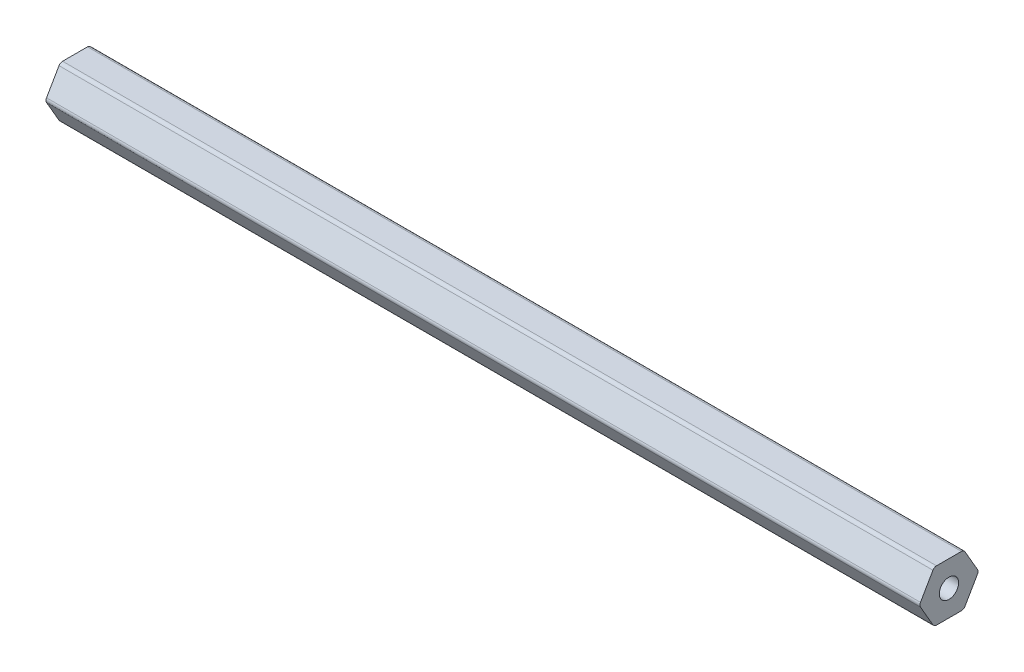
ISO-10303-21;
HEADER;
FILE_DESCRIPTION(('STEP AP214'),'2;1');
FILE_NAME('part.step','',(''),(''),'','','');
FILE_SCHEMA(('AUTOMOTIVE_DESIGN { 1 0 10303 214 1 1 1 1 }'));
ENDSEC;
DATA;
#1=APPLICATION_CONTEXT('core data for automotive mechanical design processes');
#2=APPLICATION_PROTOCOL_DEFINITION('international standard','automotive_design',2000,#1);
#3=PRODUCT_CONTEXT('',#1,'mechanical');
#4=PRODUCT('Part','Part','',(#3));
#5=PRODUCT_RELATED_PRODUCT_CATEGORY('part','',(#4));
#6=PRODUCT_DEFINITION_FORMATION('','',#4);
#7=PRODUCT_DEFINITION_CONTEXT('part definition',#1,'design');
#8=PRODUCT_DEFINITION('design','',#6,#7);
#9=PRODUCT_DEFINITION_SHAPE('','',#8);
#10=(LENGTH_UNIT() NAMED_UNIT(*) SI_UNIT(.MILLI.,.METRE.));
#11=(NAMED_UNIT(*) PLANE_ANGLE_UNIT() SI_UNIT($,.RADIAN.));
#12=(NAMED_UNIT(*) SI_UNIT($,.STERADIAN.) SOLID_ANGLE_UNIT());
#13=UNCERTAINTY_MEASURE_WITH_UNIT(LENGTH_MEASURE(1.E-05),#10,'distance_accuracy_value','');
#14=(GEOMETRIC_REPRESENTATION_CONTEXT(3) GLOBAL_UNCERTAINTY_ASSIGNED_CONTEXT((#13)) GLOBAL_UNIT_ASSIGNED_CONTEXT((#10,
#11,#12)) REPRESENTATION_CONTEXT('',''));
#15=CARTESIAN_POINT('',(0.,0.,0.));
#16=DIRECTION('',(0.,0.,1.));
#17=DIRECTION('',(1.,0.,0.));
#18=AXIS2_PLACEMENT_3D('',#15,#16,#17);
#19=CARTESIAN_POINT('',(215.9,5.334,-3.07958633585748));
#20=DIRECTION('',(-1.,0.,0.));
#21=DIRECTION('',(0.,0.,1.));
#22=AXIS2_PLACEMENT_3D('',#19,#20,#21);
#23=PLANE('',#22);
#24=CARTESIAN_POINT('',(215.9,5.334,-3.07958633585748));
#25=DIRECTION('',(1.,0.,0.));
#26=DIRECTION('',(0.,0.,1.));
#27=AXIS2_PLACEMENT_3D('',#24,#25,#26);
#28=CIRCLE('',#27,1.016);
#29=CARTESIAN_POINT('',(215.9,5.84199999999999,-3.95946814610247));
#30=VERTEX_POINT('',#29);
#31=CARTESIAN_POINT('',(215.9,6.34999999999999,-3.07958633585748));
#32=VERTEX_POINT('',#31);
#33=EDGE_CURVE('E206',#30,#32,#28,.T.);
#34=ORIENTED_EDGE('',*,*,#33,.T.);
#35=DIRECTION('',(0.,0.,1.));
#36=VECTOR('',#35,1.);
#37=CARTESIAN_POINT('',(215.9,6.34999999999999,-3.07958633585748));
#38=LINE('',#37,#36);
#39=CARTESIAN_POINT('',(215.9,6.35000000000001,3.07958633585745));
#40=VERTEX_POINT('',#39);
#41=EDGE_CURVE('E118',#32,#40,#38,.T.);
#42=ORIENTED_EDGE('',*,*,#41,.T.);
#43=CARTESIAN_POINT('',(215.9,5.33400000000001,3.07958633585745));
#44=DIRECTION('',(1.,0.,0.));
#45=DIRECTION('',(0.,0.,1.));
#46=AXIS2_PLACEMENT_3D('',#43,#44,#45);
#47=CIRCLE('',#46,1.016);
#48=CARTESIAN_POINT('',(215.9,5.84200000000001,3.95946814610244));
#49=VERTEX_POINT('',#48);
#50=EDGE_CURVE('E243',#40,#49,#47,.T.);
#51=ORIENTED_EDGE('',*,*,#50,.T.);
#52=DIRECTION('',(0.,-0.866025403784437,0.500000000000003));
#53=VECTOR('',#52,1.);
#54=CARTESIAN_POINT('',(215.9,5.84200000000001,3.95946814610244));
#55=LINE('',#54,#53);
#56=CARTESIAN_POINT('',(215.9,0.508000000000022,7.03905448195992));
#57=VERTEX_POINT('',#56);
#58=EDGE_CURVE('E263',#49,#57,#55,.T.);
#59=ORIENTED_EDGE('',*,*,#58,.T.);
#60=CARTESIAN_POINT('',(215.9,0.,6.15917267171493));
#61=DIRECTION('',(1.,0.,0.));
#62=DIRECTION('',(0.,0.,1.));
#63=AXIS2_PLACEMENT_3D('',#60,#61,#62);
#64=CIRCLE('',#63,1.016);
#65=CARTESIAN_POINT('',(215.9,-0.50799999999998,7.03905448195993));
#66=VERTEX_POINT('',#65);
#67=EDGE_CURVE('E259',#57,#66,#64,.T.);
#68=ORIENTED_EDGE('',*,*,#67,.T.);
#69=DIRECTION('',(0.,-0.86602540378444,-0.499999999999998));
#70=VECTOR('',#69,1.);
#71=CARTESIAN_POINT('',(215.9,-0.507999999999979,7.03905448195992));
#72=LINE('',#71,#70);
#73=CARTESIAN_POINT('',(215.9,-5.84199999999999,3.95946814610247));
#74=VERTEX_POINT('',#73);
#75=EDGE_CURVE('E262',#66,#74,#72,.T.);
#76=ORIENTED_EDGE('',*,*,#75,.T.);
#77=CARTESIAN_POINT('',(215.9,-5.334,3.07958633585748));
#78=DIRECTION('',(1.,0.,0.));
#79=DIRECTION('',(0.,0.,1.));
#80=AXIS2_PLACEMENT_3D('',#77,#78,#79);
#81=CIRCLE('',#80,1.016);
#82=CARTESIAN_POINT('',(215.9,-6.35,3.07958633585748));
#83=VERTEX_POINT('',#82);
#84=EDGE_CURVE('E267',#74,#83,#81,.T.);
#85=ORIENTED_EDGE('',*,*,#84,.T.);
#86=DIRECTION('',(0.,0.,-1.));
#87=VECTOR('',#86,1.);
#88=CARTESIAN_POINT('',(215.9,-6.35,3.07958633585748));
#89=LINE('',#88,#87);
#90=CARTESIAN_POINT('',(215.9,-6.35000000000001,-3.07958633585745));
#91=VERTEX_POINT('',#90);
#92=EDGE_CURVE('E274',#83,#91,#89,.T.);
#93=ORIENTED_EDGE('',*,*,#92,.T.);
#94=CARTESIAN_POINT('',(215.9,-5.33400000000001,-3.07958633585745));
#95=DIRECTION('',(1.,0.,0.));
#96=DIRECTION('',(0.,0.,1.));
#97=AXIS2_PLACEMENT_3D('',#94,#95,#96);
#98=CIRCLE('',#97,1.016);
#99=CARTESIAN_POINT('',(215.9,-5.84200000000001,-3.95946814610244));
#100=VERTEX_POINT('',#99);
#101=EDGE_CURVE('E149',#91,#100,#98,.T.);
#102=ORIENTED_EDGE('',*,*,#101,.T.);
#103=DIRECTION('',(0.,0.866025403784437,-0.500000000000002));
#104=VECTOR('',#103,1.);
#105=CARTESIAN_POINT('',(215.9,-5.84200000000001,-3.95946814610244));
#106=LINE('',#105,#104);
#107=CARTESIAN_POINT('',(215.9,-0.508000000000019,-7.03905448195992));
#108=VERTEX_POINT('',#107);
#109=EDGE_CURVE('E143',#100,#108,#106,.T.);
#110=ORIENTED_EDGE('',*,*,#109,.T.);
#111=CARTESIAN_POINT('',(215.9,0.,-6.15917267171493));
#112=DIRECTION('',(1.,0.,0.));
#113=DIRECTION('',(0.,0.,1.));
#114=AXIS2_PLACEMENT_3D('',#111,#112,#113);
#115=CIRCLE('',#114,1.016);
#116=CARTESIAN_POINT('',(215.9,0.507999999999981,-7.03905448195992));
#117=VERTEX_POINT('',#116);
#118=EDGE_CURVE('E147',#108,#117,#115,.T.);
#119=ORIENTED_EDGE('',*,*,#118,.T.);
#120=DIRECTION('',(0.,0.86602540378444,0.499999999999997));
#121=VECTOR('',#120,1.);
#122=CARTESIAN_POINT('',(215.9,0.50799999999998,-7.03905448195992));
#123=LINE('',#122,#121);
#124=EDGE_CURVE('E63',#117,#30,#123,.T.);
#125=ORIENTED_EDGE('',*,*,#124,.T.);
#126=EDGE_LOOP('',(#34,#42,#51,#59,#68,#76,#85,#93,#102,#110,#119,#125));
#127=FACE_BOUND('',#126,.T.);
#128=CARTESIAN_POINT('',(215.9,0.,0.));
#129=DIRECTION('',(1.,0.,0.));
#130=DIRECTION('',(0.,0.,-1.));
#131=AXIS2_PLACEMENT_3D('',#128,#129,#130);
#132=CIRCLE('',#131,2.38125);
#133=CARTESIAN_POINT('',(215.9,0.,-2.38125));
#134=VERTEX_POINT('',#133);
#135=EDGE_CURVE('E176',#134,#134,#132,.T.);
#136=ORIENTED_EDGE('',*,*,#135,.F.);
#137=EDGE_LOOP('',(#136));
#138=FACE_BOUND('',#137,.T.);
#139=ADVANCED_FACE('F45',(#127,#138),#23,.F.);
#140=CARTESIAN_POINT('',(0.,5.334,-3.07958633585748));
#141=DIRECTION('',(-1.,0.,0.));
#142=DIRECTION('',(0.,0.,1.));
#143=AXIS2_PLACEMENT_3D('',#140,#141,#142);
#144=PLANE('',#143);
#145=CARTESIAN_POINT('',(0.,5.334,-3.07958633585748));
#146=DIRECTION('',(1.,0.,0.));
#147=DIRECTION('',(0.,0.,1.));
#148=AXIS2_PLACEMENT_3D('',#145,#146,#147);
#149=CIRCLE('',#148,1.016);
#150=CARTESIAN_POINT('',(0.,5.84199999999999,-3.95946814610247));
#151=VERTEX_POINT('',#150);
#152=CARTESIAN_POINT('',(0.,6.34999999999999,-3.07958633585748));
#153=VERTEX_POINT('',#152);
#154=EDGE_CURVE('E171',#151,#153,#149,.T.);
#155=ORIENTED_EDGE('',*,*,#154,.F.);
#156=DIRECTION('',(0.,0.86602540378444,0.499999999999997));
#157=VECTOR('',#156,1.);
#158=CARTESIAN_POINT('',(0.,0.50799999999998,-7.03905448195992));
#159=LINE('',#158,#157);
#160=CARTESIAN_POINT('',(0.,0.507999999999981,-7.03905448195992));
#161=VERTEX_POINT('',#160);
#162=EDGE_CURVE('E110',#161,#151,#159,.T.);
#163=ORIENTED_EDGE('',*,*,#162,.F.);
#164=CARTESIAN_POINT('',(0.,0.,-6.15917267171493));
#165=DIRECTION('',(1.,0.,0.));
#166=DIRECTION('',(0.,0.,1.));
#167=AXIS2_PLACEMENT_3D('',#164,#165,#166);
#168=CIRCLE('',#167,1.016);
#169=CARTESIAN_POINT('',(0.,-0.508000000000019,-7.03905448195992));
#170=VERTEX_POINT('',#169);
#171=EDGE_CURVE('E104',#170,#161,#168,.T.);
#172=ORIENTED_EDGE('',*,*,#171,.F.);
#173=DIRECTION('',(0.,0.866025403784437,-0.500000000000002));
#174=VECTOR('',#173,1.);
#175=CARTESIAN_POINT('',(0.,-5.84200000000001,-3.95946814610244));
#176=LINE('',#175,#174);
#177=CARTESIAN_POINT('',(0.,-5.84200000000001,-3.95946814610244));
#178=VERTEX_POINT('',#177);
#179=EDGE_CURVE('E158',#178,#170,#176,.T.);
#180=ORIENTED_EDGE('',*,*,#179,.F.);
#181=CARTESIAN_POINT('',(0.,-5.33400000000001,-3.07958633585745));
#182=DIRECTION('',(1.,0.,0.));
#183=DIRECTION('',(0.,0.,1.));
#184=AXIS2_PLACEMENT_3D('',#181,#182,#183);
#185=CIRCLE('',#184,1.016);
#186=CARTESIAN_POINT('',(0.,-6.35000000000001,-3.07958633585745));
#187=VERTEX_POINT('',#186);
#188=EDGE_CURVE('E197',#187,#178,#185,.T.);
#189=ORIENTED_EDGE('',*,*,#188,.F.);
#190=DIRECTION('',(0.,0.,-1.));
#191=VECTOR('',#190,1.);
#192=CARTESIAN_POINT('',(0.,-6.35,3.07958633585748));
#193=LINE('',#192,#191);
#194=CARTESIAN_POINT('',(0.,-6.35,3.07958633585748));
#195=VERTEX_POINT('',#194);
#196=EDGE_CURVE('E194',#195,#187,#193,.T.);
#197=ORIENTED_EDGE('',*,*,#196,.F.);
#198=CARTESIAN_POINT('',(0.,-5.334,3.07958633585748));
#199=DIRECTION('',(1.,0.,0.));
#200=DIRECTION('',(0.,0.,1.));
#201=AXIS2_PLACEMENT_3D('',#198,#199,#200);
#202=CIRCLE('',#201,1.016);
#203=CARTESIAN_POINT('',(0.,-5.84199999999999,3.95946814610247));
#204=VERTEX_POINT('',#203);
#205=EDGE_CURVE('E191',#204,#195,#202,.T.);
#206=ORIENTED_EDGE('',*,*,#205,.F.);
#207=DIRECTION('',(0.,-0.86602540378444,-0.499999999999998));
#208=VECTOR('',#207,1.);
#209=CARTESIAN_POINT('',(0.,-0.507999999999979,7.03905448195992));
#210=LINE('',#209,#208);
#211=CARTESIAN_POINT('',(0.,-0.50799999999998,7.03905448195993));
#212=VERTEX_POINT('',#211);
#213=EDGE_CURVE('E188',#212,#204,#210,.T.);
#214=ORIENTED_EDGE('',*,*,#213,.F.);
#215=CARTESIAN_POINT('',(0.,0.,6.15917267171493));
#216=DIRECTION('',(1.,0.,0.));
#217=DIRECTION('',(0.,0.,1.));
#218=AXIS2_PLACEMENT_3D('',#215,#216,#217);
#219=CIRCLE('',#218,1.016);
#220=CARTESIAN_POINT('',(0.,0.508000000000022,7.03905448195992));
#221=VERTEX_POINT('',#220);
#222=EDGE_CURVE('E185',#221,#212,#219,.T.);
#223=ORIENTED_EDGE('',*,*,#222,.F.);
#224=DIRECTION('',(0.,-0.866025403784437,0.500000000000003));
#225=VECTOR('',#224,1.);
#226=CARTESIAN_POINT('',(0.,5.84200000000001,3.95946814610244));
#227=LINE('',#226,#225);
#228=CARTESIAN_POINT('',(0.,5.84200000000001,3.95946814610244));
#229=VERTEX_POINT('',#228);
#230=EDGE_CURVE('E182',#229,#221,#227,.T.);
#231=ORIENTED_EDGE('',*,*,#230,.F.);
#232=CARTESIAN_POINT('',(0.,5.33400000000001,3.07958633585745));
#233=DIRECTION('',(1.,0.,0.));
#234=DIRECTION('',(0.,0.,1.));
#235=AXIS2_PLACEMENT_3D('',#232,#233,#234);
#236=CIRCLE('',#235,1.016);
#237=CARTESIAN_POINT('',(0.,6.35000000000001,3.07958633585745));
#238=VERTEX_POINT('',#237);
#239=EDGE_CURVE('E179',#238,#229,#236,.T.);
#240=ORIENTED_EDGE('',*,*,#239,.F.);
#241=DIRECTION('',(0.,0.,1.));
#242=VECTOR('',#241,1.);
#243=CARTESIAN_POINT('',(0.,6.34999999999999,-3.07958633585748));
#244=LINE('',#243,#242);
#245=EDGE_CURVE('E175',#153,#238,#244,.T.);
#246=ORIENTED_EDGE('',*,*,#245,.F.);
#247=EDGE_LOOP('',(#155,#163,#172,#180,#189,#197,#206,#214,#223,#231,#240,#246));
#248=FACE_BOUND('',#247,.T.);
#249=CARTESIAN_POINT('',(0.,0.,0.));
#250=DIRECTION('',(1.,0.,0.));
#251=DIRECTION('',(0.,0.,-1.));
#252=AXIS2_PLACEMENT_3D('',#249,#250,#251);
#253=CIRCLE('',#252,2.38125);
#254=CARTESIAN_POINT('',(0.,0.,-2.38125));
#255=VERTEX_POINT('',#254);
#256=EDGE_CURVE('E474',#255,#255,#253,.T.);
#257=ORIENTED_EDGE('',*,*,#256,.T.);
#258=EDGE_LOOP('',(#257));
#259=FACE_BOUND('',#258,.T.);
#260=ADVANCED_FACE('F247',(#248,#259),#144,.T.);
#261=CARTESIAN_POINT('',(215.9,5.334,-3.07958633585748));
#262=DIRECTION('',(-1.,0.,0.));
#263=DIRECTION('',(0.,0.,1.));
#264=AXIS2_PLACEMENT_3D('',#261,#262,#263);
#265=CYLINDRICAL_SURFACE('',#264,1.016);
#266=ORIENTED_EDGE('',*,*,#154,.T.);
#267=DIRECTION('',(-1.,0.,0.));
#268=VECTOR('',#267,1.);
#269=CARTESIAN_POINT('',(215.9,6.34999999999999,-3.07958633585748));
#270=LINE('',#269,#268);
#271=EDGE_CURVE('E11',#32,#153,#270,.T.);
#272=ORIENTED_EDGE('',*,*,#271,.F.);
#273=ORIENTED_EDGE('',*,*,#33,.F.);
#274=DIRECTION('',(-1.,0.,0.));
#275=VECTOR('',#274,1.);
#276=CARTESIAN_POINT('',(215.9,5.84199999999999,-3.95946814610247));
#277=LINE('',#276,#275);
#278=EDGE_CURVE('E167',#30,#151,#277,.T.);
#279=ORIENTED_EDGE('',*,*,#278,.T.);
#280=EDGE_LOOP('',(#266,#272,#273,#279));
#281=FACE_BOUND('',#280,.T.);
#282=ADVANCED_FACE('F47',(#281),#265,.T.);
#283=CARTESIAN_POINT('',(215.9,6.34999999999999,-3.07958633585748));
#284=DIRECTION('',(0.,-1.,0.));
#285=DIRECTION('',(0.,0.,-1.));
#286=AXIS2_PLACEMENT_3D('',#283,#284,#285);
#287=PLANE('',#286);
#288=ORIENTED_EDGE('',*,*,#245,.T.);
#289=DIRECTION('',(-1.,0.,0.));
#290=VECTOR('',#289,1.);
#291=CARTESIAN_POINT('',(215.9,6.35000000000001,3.07958633585745));
#292=LINE('',#291,#290);
#293=EDGE_CURVE('E55',#40,#238,#292,.T.);
#294=ORIENTED_EDGE('',*,*,#293,.F.);
#295=ORIENTED_EDGE('',*,*,#41,.F.);
#296=ORIENTED_EDGE('',*,*,#271,.T.);
#297=EDGE_LOOP('',(#288,#294,#295,#296));
#298=FACE_BOUND('',#297,.T.);
#299=ADVANCED_FACE('F310',(#298),#287,.F.);
#300=CARTESIAN_POINT('',(215.9,5.33400000000001,3.07958633585745));
#301=DIRECTION('',(-1.,0.,0.));
#302=DIRECTION('',(0.,0.,1.));
#303=AXIS2_PLACEMENT_3D('',#300,#301,#302);
#304=CYLINDRICAL_SURFACE('',#303,1.016);
#305=ORIENTED_EDGE('',*,*,#239,.T.);
#306=DIRECTION('',(-1.,0.,0.));
#307=VECTOR('',#306,1.);
#308=CARTESIAN_POINT('',(215.9,5.84200000000001,3.95946814610244));
#309=LINE('',#308,#307);
#310=EDGE_CURVE('E233',#49,#229,#309,.T.);
#311=ORIENTED_EDGE('',*,*,#310,.F.);
#312=ORIENTED_EDGE('',*,*,#50,.F.);
#313=ORIENTED_EDGE('',*,*,#293,.T.);
#314=EDGE_LOOP('',(#305,#311,#312,#313));
#315=FACE_BOUND('',#314,.T.);
#316=ADVANCED_FACE('F241',(#315),#304,.T.);
#317=CARTESIAN_POINT('',(215.9,5.84200000000001,3.95946814610244));
#318=DIRECTION('',(0.,-0.500000000000003,-0.866025403784437));
#319=DIRECTION('',(0.,0.866025403784437,-0.500000000000003));
#320=AXIS2_PLACEMENT_3D('',#317,#318,#319);
#321=PLANE('',#320);
#322=ORIENTED_EDGE('',*,*,#230,.T.);
#323=DIRECTION('',(-1.,0.,0.));
#324=VECTOR('',#323,1.);
#325=CARTESIAN_POINT('',(215.9,0.508000000000022,7.03905448195992));
#326=LINE('',#325,#324);
#327=EDGE_CURVE('E229',#57,#221,#326,.T.);
#328=ORIENTED_EDGE('',*,*,#327,.F.);
#329=ORIENTED_EDGE('',*,*,#58,.F.);
#330=ORIENTED_EDGE('',*,*,#310,.T.);
#331=EDGE_LOOP('',(#322,#328,#329,#330));
#332=FACE_BOUND('',#331,.T.);
#333=ADVANCED_FACE('F253',(#332),#321,.F.);
#334=CARTESIAN_POINT('',(215.9,0.,6.15917267171493));
#335=DIRECTION('',(-1.,0.,0.));
#336=DIRECTION('',(0.,0.,1.));
#337=AXIS2_PLACEMENT_3D('',#334,#335,#336);
#338=CYLINDRICAL_SURFACE('',#337,1.016);
#339=ORIENTED_EDGE('',*,*,#222,.T.);
#340=DIRECTION('',(-1.,0.,0.));
#341=VECTOR('',#340,1.);
#342=CARTESIAN_POINT('',(215.9,-0.50799999999998,7.03905448195993));
#343=LINE('',#342,#341);
#344=EDGE_CURVE('E225',#66,#212,#343,.T.);
#345=ORIENTED_EDGE('',*,*,#344,.F.);
#346=ORIENTED_EDGE('',*,*,#67,.F.);
#347=ORIENTED_EDGE('',*,*,#327,.T.);
#348=EDGE_LOOP('',(#339,#345,#346,#347));
#349=FACE_BOUND('',#348,.T.);
#350=ADVANCED_FACE('F257',(#349),#338,.T.);
#351=CARTESIAN_POINT('',(215.9,-0.507999999999979,7.03905448195992));
#352=DIRECTION('',(0.,0.499999999999998,-0.86602540378444));
#353=DIRECTION('',(0.,0.86602540378444,0.499999999999998));
#354=AXIS2_PLACEMENT_3D('',#351,#352,#353);
#355=PLANE('',#354);
#356=ORIENTED_EDGE('',*,*,#213,.T.);
#357=DIRECTION('',(-1.,0.,0.));
#358=VECTOR('',#357,1.);
#359=CARTESIAN_POINT('',(215.9,-5.84199999999999,3.95946814610247));
#360=LINE('',#359,#358);
#361=EDGE_CURVE('E221',#74,#204,#360,.T.);
#362=ORIENTED_EDGE('',*,*,#361,.F.);
#363=ORIENTED_EDGE('',*,*,#75,.F.);
#364=ORIENTED_EDGE('',*,*,#344,.T.);
#365=EDGE_LOOP('',(#356,#362,#363,#364));
#366=FACE_BOUND('',#365,.T.);
#367=ADVANCED_FACE('F323',(#366),#355,.F.);
#368=CARTESIAN_POINT('',(215.9,-5.334,3.07958633585748));
#369=DIRECTION('',(-1.,0.,0.));
#370=DIRECTION('',(0.,0.,1.));
#371=AXIS2_PLACEMENT_3D('',#368,#369,#370);
#372=CYLINDRICAL_SURFACE('',#371,1.016);
#373=ORIENTED_EDGE('',*,*,#205,.T.);
#374=DIRECTION('',(-1.,0.,0.));
#375=VECTOR('',#374,1.);
#376=CARTESIAN_POINT('',(215.9,-6.35,3.07958633585748));
#377=LINE('',#376,#375);
#378=EDGE_CURVE('E217',#83,#195,#377,.T.);
#379=ORIENTED_EDGE('',*,*,#378,.F.);
#380=ORIENTED_EDGE('',*,*,#84,.F.);
#381=ORIENTED_EDGE('',*,*,#361,.T.);
#382=EDGE_LOOP('',(#373,#379,#380,#381));
#383=FACE_BOUND('',#382,.T.);
#384=ADVANCED_FACE('F326',(#383),#372,.T.);
#385=CARTESIAN_POINT('',(215.9,-6.35,3.07958633585748));
#386=DIRECTION('',(0.,1.,0.));
#387=DIRECTION('',(0.,0.,1.));
#388=AXIS2_PLACEMENT_3D('',#385,#386,#387);
#389=PLANE('',#388);
#390=ORIENTED_EDGE('',*,*,#196,.T.);
#391=DIRECTION('',(-1.,0.,0.));
#392=VECTOR('',#391,1.);
#393=CARTESIAN_POINT('',(215.9,-6.35000000000001,-3.07958633585745));
#394=LINE('',#393,#392);
#395=EDGE_CURVE('E213',#91,#187,#394,.T.);
#396=ORIENTED_EDGE('',*,*,#395,.F.);
#397=ORIENTED_EDGE('',*,*,#92,.F.);
#398=ORIENTED_EDGE('',*,*,#378,.T.);
#399=EDGE_LOOP('',(#390,#396,#397,#398));
#400=FACE_BOUND('',#399,.T.);
#401=ADVANCED_FACE('F282',(#400),#389,.F.);
#402=CARTESIAN_POINT('',(215.9,-5.33400000000001,-3.07958633585745));
#403=DIRECTION('',(-1.,0.,0.));
#404=DIRECTION('',(0.,0.,1.));
#405=AXIS2_PLACEMENT_3D('',#402,#403,#404);
#406=CYLINDRICAL_SURFACE('',#405,1.016);
#407=ORIENTED_EDGE('',*,*,#188,.T.);
#408=DIRECTION('',(-1.,0.,0.));
#409=VECTOR('',#408,1.);
#410=CARTESIAN_POINT('',(215.9,-5.84200000000001,-3.95946814610244));
#411=LINE('',#410,#409);
#412=EDGE_CURVE('E160',#100,#178,#411,.T.);
#413=ORIENTED_EDGE('',*,*,#412,.F.);
#414=ORIENTED_EDGE('',*,*,#101,.F.);
#415=ORIENTED_EDGE('',*,*,#395,.T.);
#416=EDGE_LOOP('',(#407,#413,#414,#415));
#417=FACE_BOUND('',#416,.T.);
#418=ADVANCED_FACE('F286',(#417),#406,.T.);
#419=CARTESIAN_POINT('',(215.9,-5.84200000000001,-3.95946814610244));
#420=DIRECTION('',(0.,0.500000000000002,0.866025403784437));
#421=DIRECTION('',(0.,-0.866025403784437,0.500000000000002));
#422=AXIS2_PLACEMENT_3D('',#419,#420,#421);
#423=PLANE('',#422);
#424=ORIENTED_EDGE('',*,*,#179,.T.);
#425=DIRECTION('',(-1.,0.,0.));
#426=VECTOR('',#425,1.);
#427=CARTESIAN_POINT('',(215.9,-0.508000000000019,-7.03905448195992));
#428=LINE('',#427,#426);
#429=EDGE_CURVE('E155',#108,#170,#428,.T.);
#430=ORIENTED_EDGE('',*,*,#429,.F.);
#431=ORIENTED_EDGE('',*,*,#109,.F.);
#432=ORIENTED_EDGE('',*,*,#412,.T.);
#433=EDGE_LOOP('',(#424,#430,#431,#432));
#434=FACE_BOUND('',#433,.T.);
#435=ADVANCED_FACE('F156',(#434),#423,.F.);
#436=CARTESIAN_POINT('',(215.9,0.,-6.15917267171493));
#437=DIRECTION('',(-1.,0.,0.));
#438=DIRECTION('',(0.,0.,1.));
#439=AXIS2_PLACEMENT_3D('',#436,#437,#438);
#440=CYLINDRICAL_SURFACE('',#439,1.016);
#441=ORIENTED_EDGE('',*,*,#171,.T.);
#442=DIRECTION('',(-1.,0.,0.));
#443=VECTOR('',#442,1.);
#444=CARTESIAN_POINT('',(215.9,0.507999999999981,-7.03905448195992));
#445=LINE('',#444,#443);
#446=EDGE_CURVE('E161',#117,#161,#445,.T.);
#447=ORIENTED_EDGE('',*,*,#446,.F.);
#448=ORIENTED_EDGE('',*,*,#118,.F.);
#449=ORIENTED_EDGE('',*,*,#429,.T.);
#450=EDGE_LOOP('',(#441,#447,#448,#449));
#451=FACE_BOUND('',#450,.T.);
#452=ADVANCED_FACE('F163',(#451),#440,.T.);
#453=CARTESIAN_POINT('',(215.9,0.50799999999998,-7.03905448195992));
#454=DIRECTION('',(0.,-0.499999999999997,0.86602540378444));
#455=DIRECTION('',(0.,-0.86602540378444,-0.499999999999997));
#456=AXIS2_PLACEMENT_3D('',#453,#454,#455);
#457=PLANE('',#456);
#458=ORIENTED_EDGE('',*,*,#162,.T.);
#459=ORIENTED_EDGE('',*,*,#278,.F.);
#460=ORIENTED_EDGE('',*,*,#124,.F.);
#461=ORIENTED_EDGE('',*,*,#446,.T.);
#462=EDGE_LOOP('',(#458,#459,#460,#461));
#463=FACE_BOUND('',#462,.T.);
#464=ADVANCED_FACE('F290',(#463),#457,.F.);
#465=CARTESIAN_POINT('',(215.9,0.,0.));
#466=DIRECTION('',(-1.,0.,0.));
#467=DIRECTION('',(0.,0.,1.));
#468=AXIS2_PLACEMENT_3D('',#465,#466,#467);
#469=CYLINDRICAL_SURFACE('',#468,2.38125);
#470=ORIENTED_EDGE('',*,*,#135,.T.);
#471=EDGE_LOOP('',(#470));
#472=FACE_BOUND('',#471,.T.);
#473=ORIENTED_EDGE('',*,*,#256,.F.);
#474=EDGE_LOOP('',(#473));
#475=FACE_BOUND('',#474,.T.);
#476=ADVANCED_FACE('F292',(#472,#475),#469,.F.);
#477=CLOSED_SHELL('',(#139,#260,#282,#299,#316,#333,#350,#367,#384,#401,#418,#435,#452,#464,#476));
#478=MANIFOLD_SOLID_BREP('B2',#477);
#479=ADVANCED_BREP_SHAPE_REPRESENTATION('',(#18,#478),#14);
#480=SHAPE_DEFINITION_REPRESENTATION(#9,#479);
ENDSEC;
END-ISO-10303-21;
